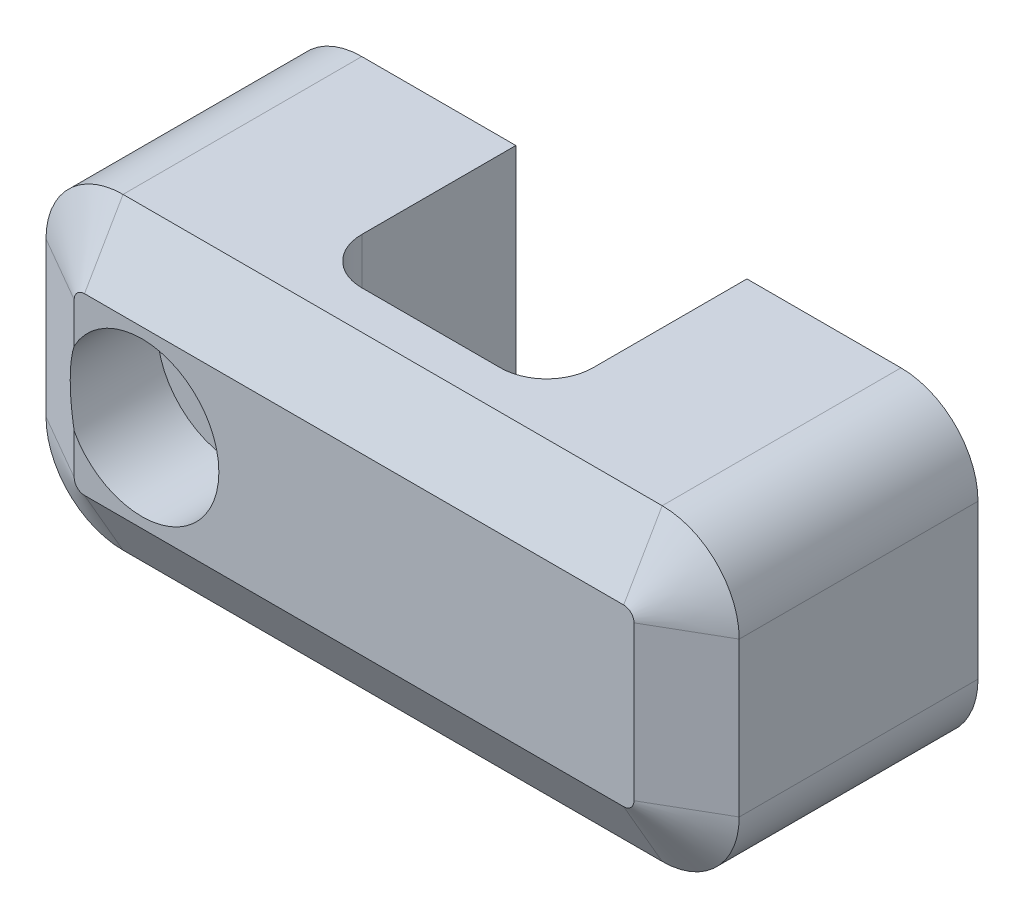
ISO-10303-21;
HEADER;
FILE_DESCRIPTION(('STEP AP214'),'2;1');
FILE_NAME('part.step','',(''),(''),'','','');
FILE_SCHEMA(('AUTOMOTIVE_DESIGN { 1 0 10303 214 1 1 1 1 }'));
ENDSEC;
DATA;
#1=APPLICATION_CONTEXT('core data for automotive mechanical design processes');
#2=APPLICATION_PROTOCOL_DEFINITION('international standard','automotive_design',2000,#1);
#3=PRODUCT_CONTEXT('',#1,'mechanical');
#4=PRODUCT('Part','Part','',(#3));
#5=PRODUCT_RELATED_PRODUCT_CATEGORY('part','',(#4));
#6=PRODUCT_DEFINITION_FORMATION('','',#4);
#7=PRODUCT_DEFINITION_CONTEXT('part definition',#1,'design');
#8=PRODUCT_DEFINITION('design','',#6,#7);
#9=PRODUCT_DEFINITION_SHAPE('','',#8);
#10=(LENGTH_UNIT() NAMED_UNIT(*) SI_UNIT(.MILLI.,.METRE.));
#11=(NAMED_UNIT(*) PLANE_ANGLE_UNIT() SI_UNIT($,.RADIAN.));
#12=(NAMED_UNIT(*) SI_UNIT($,.STERADIAN.) SOLID_ANGLE_UNIT());
#13=UNCERTAINTY_MEASURE_WITH_UNIT(LENGTH_MEASURE(1.E-05),#10,'distance_accuracy_value','');
#14=(GEOMETRIC_REPRESENTATION_CONTEXT(3) GLOBAL_UNCERTAINTY_ASSIGNED_CONTEXT((#13)) GLOBAL_UNIT_ASSIGNED_CONTEXT((#10,
#11,#12)) REPRESENTATION_CONTEXT('',''));
#15=CARTESIAN_POINT('',(0.,0.,0.));
#16=DIRECTION('',(0.,0.,1.));
#17=DIRECTION('',(1.,0.,0.));
#18=AXIS2_PLACEMENT_3D('',#15,#16,#17);
#19=CARTESIAN_POINT('',(-4.5,10.,-3.));
#20=DIRECTION('',(0.,1.,0.));
#21=DIRECTION('',(-1.,0.,0.));
#22=AXIS2_PLACEMENT_3D('',#19,#20,#21);
#23=CYLINDRICAL_SURFACE('',#22,3.);
#24=DIRECTION('',(0.,-1.,0.));
#25=VECTOR('',#24,1.);
#26=CARTESIAN_POINT('',(-7.5,10.,-3.));
#27=LINE('',#26,#25);
#28=CARTESIAN_POINT('',(-7.5,10.,-3.));
#29=VERTEX_POINT('',#28);
#30=CARTESIAN_POINT('',(-7.50000000000001,-10.,-3.));
#31=VERTEX_POINT('',#30);
#32=EDGE_CURVE('E213',#29,#31,#27,.T.);
#33=ORIENTED_EDGE('',*,*,#32,.F.);
#34=CARTESIAN_POINT('',(-4.5,10.,-3.));
#35=DIRECTION('',(0.,-1.,0.));
#36=DIRECTION('',(1.,0.,0.));
#37=AXIS2_PLACEMENT_3D('',#34,#35,#36);
#38=CIRCLE('',#37,3.);
#39=CARTESIAN_POINT('',(-4.5,10.,0.));
#40=VERTEX_POINT('',#39);
#41=EDGE_CURVE('E218',#29,#40,#38,.F.);
#42=ORIENTED_EDGE('',*,*,#41,.T.);
#43=DIRECTION('',(0.,-1.,0.));
#44=VECTOR('',#43,1.);
#45=CARTESIAN_POINT('',(-4.5,10.,0.));
#46=LINE('',#45,#44);
#47=CARTESIAN_POINT('',(-4.5,-10.,0.));
#48=VERTEX_POINT('',#47);
#49=EDGE_CURVE('E215',#48,#40,#46,.F.);
#50=ORIENTED_EDGE('',*,*,#49,.F.);
#51=CARTESIAN_POINT('',(-4.50000000000001,-10.,-3.));
#52=DIRECTION('',(0.,1.,0.));
#53=DIRECTION('',(-1.,0.,0.));
#54=AXIS2_PLACEMENT_3D('',#51,#52,#53);
#55=CIRCLE('',#54,3.);
#56=EDGE_CURVE('E221',#48,#31,#55,.F.);
#57=ORIENTED_EDGE('',*,*,#56,.T.);
#58=EDGE_LOOP('',(#33,#42,#50,#57));
#59=FACE_BOUND('',#58,.T.);
#60=ADVANCED_FACE('F33',(#59),#23,.F.);
#61=CARTESIAN_POINT('',(0.,0.,0.));
#62=DIRECTION('',(0.,0.,1.));
#63=DIRECTION('',(1.,0.,0.));
#64=AXIS2_PLACEMENT_3D('',#61,#62,#63);
#65=PLANE('',#64);
#66=DIRECTION('',(-1.,0.,0.));
#67=VECTOR('',#66,1.);
#68=CARTESIAN_POINT('',(22.5,10.,0.));
#69=LINE('',#68,#67);
#70=CARTESIAN_POINT('',(4.5,10.,0.));
#71=VERTEX_POINT('',#70);
#72=EDGE_CURVE('E211',#71,#40,#69,.T.);
#73=ORIENTED_EDGE('',*,*,#72,.F.);
#74=DIRECTION('',(0.,1.,0.));
#75=VECTOR('',#74,1.);
#76=CARTESIAN_POINT('',(4.49999999999998,-10.,0.));
#77=LINE('',#76,#75);
#78=CARTESIAN_POINT('',(4.49999999999999,-10.,0.));
#79=VERTEX_POINT('',#78);
#80=EDGE_CURVE('E54',#71,#79,#77,.F.);
#81=ORIENTED_EDGE('',*,*,#80,.T.);
#82=DIRECTION('',(1.,0.,0.));
#83=VECTOR('',#82,1.);
#84=CARTESIAN_POINT('',(22.5,-10.,0.));
#85=LINE('',#84,#83);
#86=EDGE_CURVE('E208',#48,#79,#85,.T.);
#87=ORIENTED_EDGE('',*,*,#86,.F.);
#88=ORIENTED_EDGE('',*,*,#49,.T.);
#89=EDGE_LOOP('',(#73,#81,#87,#88));
#90=FACE_BOUND('',#89,.T.);
#91=ADVANCED_FACE('F418',(#90),#65,.F.);
#92=CARTESIAN_POINT('',(-22.5,-10.,5.));
#93=DIRECTION('',(1.,0.,0.));
#94=DIRECTION('',(0.,0.,-1.));
#95=AXIS2_PLACEMENT_3D('',#92,#93,#94);
#96=PLANE('',#95);
#97=DIRECTION('',(0.,0.,-1.));
#98=VECTOR('',#97,1.);
#99=CARTESIAN_POINT('',(-22.5,-5.,5.));
#100=LINE('',#99,#98);
#101=CARTESIAN_POINT('',(-22.5,-5.,-13.));
#102=VERTEX_POINT('',#101);
#103=CARTESIAN_POINT('',(-22.5,-5.,2.49999999999999));
#104=VERTEX_POINT('',#103);
#105=EDGE_CURVE('E257',#102,#104,#100,.F.);
#106=ORIENTED_EDGE('',*,*,#105,.T.);
#107=DIRECTION('',(0.,1.,0.));
#108=VECTOR('',#107,1.);
#109=CARTESIAN_POINT('',(-22.5,5.,2.49999999999999));
#110=LINE('',#109,#108);
#111=CARTESIAN_POINT('',(-22.5,5.,2.49999999999999));
#112=VERTEX_POINT('',#111);
#113=EDGE_CURVE('E290',#104,#112,#110,.T.);
#114=ORIENTED_EDGE('',*,*,#113,.T.);
#115=DIRECTION('',(0.,0.,-1.));
#116=VECTOR('',#115,1.);
#117=CARTESIAN_POINT('',(-22.5,5.,5.));
#118=LINE('',#117,#116);
#119=CARTESIAN_POINT('',(-22.5,5.,-13.));
#120=VERTEX_POINT('',#119);
#121=EDGE_CURVE('E255',#112,#120,#118,.T.);
#122=ORIENTED_EDGE('',*,*,#121,.T.);
#123=DIRECTION('',(0.,1.,0.));
#124=VECTOR('',#123,1.);
#125=CARTESIAN_POINT('',(-22.5,10.,-13.));
#126=LINE('',#125,#124);
#127=EDGE_CURVE('E184',#102,#120,#126,.T.);
#128=ORIENTED_EDGE('',*,*,#127,.F.);
#129=EDGE_LOOP('',(#106,#114,#122,#128));
#130=FACE_BOUND('',#129,.T.);
#131=ADVANCED_FACE('F383',(#130),#96,.F.);
#132=CARTESIAN_POINT('',(22.5,-10.,5.));
#133=DIRECTION('',(0.,1.,0.));
#134=DIRECTION('',(-1.,0.,0.));
#135=AXIS2_PLACEMENT_3D('',#132,#133,#134);
#136=PLANE('',#135);
#137=ORIENTED_EDGE('',*,*,#56,.F.);
#138=ORIENTED_EDGE('',*,*,#86,.T.);
#139=CARTESIAN_POINT('',(4.49999999999998,-10.,-3.));
#140=DIRECTION('',(0.,1.,0.));
#141=DIRECTION('',(-1.,0.,0.));
#142=AXIS2_PLACEMENT_3D('',#139,#140,#141);
#143=CIRCLE('',#142,3.);
#144=CARTESIAN_POINT('',(7.49999999999998,-10.,-3.));
#145=VERTEX_POINT('',#144);
#146=EDGE_CURVE('E11',#79,#145,#143,.T.);
#147=ORIENTED_EDGE('',*,*,#146,.T.);
#148=DIRECTION('',(0.,0.,1.));
#149=VECTOR('',#148,1.);
#150=CARTESIAN_POINT('',(7.49999999999998,-10.,-13.));
#151=LINE('',#150,#149);
#152=CARTESIAN_POINT('',(7.49999999999998,-10.,-13.));
#153=VERTEX_POINT('',#152);
#154=EDGE_CURVE('E178',#153,#145,#151,.T.);
#155=ORIENTED_EDGE('',*,*,#154,.F.);
#156=DIRECTION('',(-1.,0.,0.));
#157=VECTOR('',#156,1.);
#158=CARTESIAN_POINT('',(22.5,-10.,-13.));
#159=LINE('',#158,#157);
#160=CARTESIAN_POINT('',(17.5,-10.,-13.));
#161=VERTEX_POINT('',#160);
#162=EDGE_CURVE('E162',#161,#153,#159,.T.);
#163=ORIENTED_EDGE('',*,*,#162,.F.);
#164=DIRECTION('',(0.,0.,-1.));
#165=VECTOR('',#164,1.);
#166=CARTESIAN_POINT('',(17.5,-10.,5.));
#167=LINE('',#166,#165);
#168=CARTESIAN_POINT('',(17.5,-10.,2.49999999999999));
#169=VERTEX_POINT('',#168);
#170=EDGE_CURVE('E244',#161,#169,#167,.F.);
#171=ORIENTED_EDGE('',*,*,#170,.T.);
#172=DIRECTION('',(-1.,0.,0.));
#173=VECTOR('',#172,1.);
#174=CARTESIAN_POINT('',(-17.5,-10.,2.49999999999999));
#175=LINE('',#174,#173);
#176=CARTESIAN_POINT('',(-17.5,-10.,2.49999999999999));
#177=VERTEX_POINT('',#176);
#178=EDGE_CURVE('E279',#169,#177,#175,.T.);
#179=ORIENTED_EDGE('',*,*,#178,.T.);
#180=DIRECTION('',(0.,0.,-1.));
#181=VECTOR('',#180,1.);
#182=CARTESIAN_POINT('',(-17.5,-10.,5.));
#183=LINE('',#182,#181);
#184=CARTESIAN_POINT('',(-17.5,-10.,-13.));
#185=VERTEX_POINT('',#184);
#186=EDGE_CURVE('E242',#177,#185,#183,.T.);
#187=ORIENTED_EDGE('',*,*,#186,.T.);
#188=DIRECTION('',(-1.,0.,0.));
#189=VECTOR('',#188,1.);
#190=CARTESIAN_POINT('',(-22.5,-10.,-13.));
#191=LINE('',#190,#189);
#192=CARTESIAN_POINT('',(-7.50000000000001,-10.,-13.));
#193=VERTEX_POINT('',#192);
#194=EDGE_CURVE('E199',#193,#185,#191,.T.);
#195=ORIENTED_EDGE('',*,*,#194,.F.);
#196=DIRECTION('',(0.,0.,1.));
#197=VECTOR('',#196,1.);
#198=CARTESIAN_POINT('',(-7.50000000000001,-10.,-13.));
#199=LINE('',#198,#197);
#200=EDGE_CURVE('E202',#193,#31,#199,.T.);
#201=ORIENTED_EDGE('',*,*,#200,.T.);
#202=EDGE_LOOP('',(#137,#138,#147,#155,#163,#171,#179,#187,#195,#201));
#203=FACE_BOUND('',#202,.T.);
#204=ADVANCED_FACE('F179',(#203),#136,.F.);
#205=CARTESIAN_POINT('',(22.5,-10.,5.));
#206=DIRECTION('',(-1.,0.,0.));
#207=DIRECTION('',(0.,0.,1.));
#208=AXIS2_PLACEMENT_3D('',#205,#206,#207);
#209=PLANE('',#208);
#210=DIRECTION('',(0.,0.,-1.));
#211=VECTOR('',#210,1.);
#212=CARTESIAN_POINT('',(22.5,5.,5.));
#213=LINE('',#212,#211);
#214=CARTESIAN_POINT('',(22.5,5.,-13.));
#215=VERTEX_POINT('',#214);
#216=CARTESIAN_POINT('',(22.5,5.,2.49999999999999));
#217=VERTEX_POINT('',#216);
#218=EDGE_CURVE('E226',#215,#217,#213,.F.);
#219=ORIENTED_EDGE('',*,*,#218,.T.);
#220=DIRECTION('',(0.,-1.,0.));
#221=VECTOR('',#220,1.);
#222=CARTESIAN_POINT('',(22.5,-5.,2.49999999999999));
#223=LINE('',#222,#221);
#224=CARTESIAN_POINT('',(22.5,-5.,2.49999999999999));
#225=VERTEX_POINT('',#224);
#226=EDGE_CURVE('E286',#217,#225,#223,.T.);
#227=ORIENTED_EDGE('',*,*,#226,.T.);
#228=DIRECTION('',(0.,0.,-1.));
#229=VECTOR('',#228,1.);
#230=CARTESIAN_POINT('',(22.5,-5.,5.));
#231=LINE('',#230,#229);
#232=CARTESIAN_POINT('',(22.5,-5.,-13.));
#233=VERTEX_POINT('',#232);
#234=EDGE_CURVE('E228',#225,#233,#231,.T.);
#235=ORIENTED_EDGE('',*,*,#234,.T.);
#236=DIRECTION('',(0.,-1.,0.));
#237=VECTOR('',#236,1.);
#238=CARTESIAN_POINT('',(22.5,9.99999999999998,-13.));
#239=LINE('',#238,#237);
#240=EDGE_CURVE('E175',#215,#233,#239,.T.);
#241=ORIENTED_EDGE('',*,*,#240,.F.);
#242=EDGE_LOOP('',(#219,#227,#235,#241));
#243=FACE_BOUND('',#242,.T.);
#244=ADVANCED_FACE('F339',(#243),#209,.F.);
#245=CARTESIAN_POINT('',(22.5,10.,5.));
#246=DIRECTION('',(0.,-1.,0.));
#247=DIRECTION('',(1.,0.,0.));
#248=AXIS2_PLACEMENT_3D('',#245,#246,#247);
#249=PLANE('',#248);
#250=DIRECTION('',(0.,0.,-1.));
#251=VECTOR('',#250,1.);
#252=CARTESIAN_POINT('',(-17.5,10.,5.));
#253=LINE('',#252,#251);
#254=CARTESIAN_POINT('',(-17.5,10.,-13.));
#255=VERTEX_POINT('',#254);
#256=CARTESIAN_POINT('',(-17.5,10.,2.49999999999999));
#257=VERTEX_POINT('',#256);
#258=EDGE_CURVE('E246',#255,#257,#253,.F.);
#259=ORIENTED_EDGE('',*,*,#258,.T.);
#260=DIRECTION('',(1.,0.,0.));
#261=VECTOR('',#260,1.);
#262=CARTESIAN_POINT('',(17.5,10.,2.49999999999999));
#263=LINE('',#262,#261);
#264=CARTESIAN_POINT('',(17.5,10.,2.49999999999999));
#265=VERTEX_POINT('',#264);
#266=EDGE_CURVE('E296',#257,#265,#263,.T.);
#267=ORIENTED_EDGE('',*,*,#266,.T.);
#268=DIRECTION('',(0.,0.,-1.));
#269=VECTOR('',#268,1.);
#270=CARTESIAN_POINT('',(17.5,10.,5.));
#271=LINE('',#270,#269);
#272=CARTESIAN_POINT('',(17.5,9.99999999999998,-13.));
#273=VERTEX_POINT('',#272);
#274=EDGE_CURVE('E249',#265,#273,#271,.T.);
#275=ORIENTED_EDGE('',*,*,#274,.T.);
#276=DIRECTION('',(1.,0.,0.));
#277=VECTOR('',#276,1.);
#278=CARTESIAN_POINT('',(22.5,9.99999999999998,-13.));
#279=LINE('',#278,#277);
#280=CARTESIAN_POINT('',(7.5,9.99999999999999,-13.));
#281=VERTEX_POINT('',#280);
#282=EDGE_CURVE('E335',#281,#273,#279,.T.);
#283=ORIENTED_EDGE('',*,*,#282,.F.);
#284=DIRECTION('',(0.,0.,1.));
#285=VECTOR('',#284,1.);
#286=CARTESIAN_POINT('',(7.5,9.99999999999999,-13.));
#287=LINE('',#286,#285);
#288=CARTESIAN_POINT('',(7.5,9.99999999999999,-3.));
#289=VERTEX_POINT('',#288);
#290=EDGE_CURVE('E185',#281,#289,#287,.T.);
#291=ORIENTED_EDGE('',*,*,#290,.T.);
#292=CARTESIAN_POINT('',(4.5,10.,-3.));
#293=DIRECTION('',(0.,-1.,0.));
#294=DIRECTION('',(1.,0.,0.));
#295=AXIS2_PLACEMENT_3D('',#292,#293,#294);
#296=CIRCLE('',#295,3.);
#297=EDGE_CURVE('E41',#289,#71,#296,.T.);
#298=ORIENTED_EDGE('',*,*,#297,.T.);
#299=ORIENTED_EDGE('',*,*,#72,.T.);
#300=ORIENTED_EDGE('',*,*,#41,.F.);
#301=DIRECTION('',(0.,0.,1.));
#302=VECTOR('',#301,1.);
#303=CARTESIAN_POINT('',(-7.5,10.,-13.));
#304=LINE('',#303,#302);
#305=CARTESIAN_POINT('',(-7.5,10.,-13.));
#306=VERTEX_POINT('',#305);
#307=EDGE_CURVE('E212',#306,#29,#304,.T.);
#308=ORIENTED_EDGE('',*,*,#307,.F.);
#309=DIRECTION('',(1.,0.,0.));
#310=VECTOR('',#309,1.);
#311=CARTESIAN_POINT('',(-22.5,10.,-13.));
#312=LINE('',#311,#310);
#313=EDGE_CURVE('E195',#255,#306,#312,.T.);
#314=ORIENTED_EDGE('',*,*,#313,.F.);
#315=EDGE_LOOP('',(#259,#267,#275,#283,#291,#298,#299,#300,#308,#314));
#316=FACE_BOUND('',#315,.T.);
#317=ADVANCED_FACE('F397',(#316),#249,.F.);
#318=CARTESIAN_POINT('',(0.,0.,5.));
#319=DIRECTION('',(0.,0.,1.));
#320=DIRECTION('',(1.,0.,0.));
#321=AXIS2_PLACEMENT_3D('',#318,#319,#320);
#322=PLANE('',#321);
#323=CARTESIAN_POINT('',(-13.7784095503576,0.,5.));
#324=DIRECTION('',(0.,0.,1.));
#325=DIRECTION('',(1.,0.,0.));
#326=AXIS2_PLACEMENT_3D('',#323,#324,#325);
#327=CIRCLE('',#326,5.);
#328=CARTESIAN_POINT('',(-18.1698729810778,-2.39061685274892,5.));
#329=VERTEX_POINT('',#328);
#330=CARTESIAN_POINT('',(-18.1698729810778,2.39061685274891,5.));
#331=VERTEX_POINT('',#330);
#332=EDGE_CURVE('E329',#329,#331,#327,.T.);
#333=ORIENTED_EDGE('',*,*,#332,.F.);
#334=DIRECTION('',(0.,-1.,0.));
#335=VECTOR('',#334,1.);
#336=CARTESIAN_POINT('',(-18.1698729810778,-5.,5.));
#337=LINE('',#336,#335);
#338=CARTESIAN_POINT('',(-18.1698729810778,-5.,5.));
#339=VERTEX_POINT('',#338);
#340=EDGE_CURVE('E277',#329,#339,#337,.T.);
#341=ORIENTED_EDGE('',*,*,#340,.T.);
#342=CARTESIAN_POINT('',(-17.5,-5.,5.));
#343=DIRECTION('',(0.,0.,1.));
#344=DIRECTION('',(1.,0.,0.));
#345=AXIS2_PLACEMENT_3D('',#342,#343,#344);
#346=CIRCLE('',#345,0.669872981077815);
#347=CARTESIAN_POINT('',(-17.5,-5.66987298107782,5.));
#348=VERTEX_POINT('',#347);
#349=EDGE_CURVE('E275',#339,#348,#346,.T.);
#350=ORIENTED_EDGE('',*,*,#349,.T.);
#351=DIRECTION('',(1.,0.,0.));
#352=VECTOR('',#351,1.);
#353=CARTESIAN_POINT('',(17.5,-5.66987298107781,5.));
#354=LINE('',#353,#352);
#355=CARTESIAN_POINT('',(17.5,-5.66987298107781,5.));
#356=VERTEX_POINT('',#355);
#357=EDGE_CURVE('E272',#348,#356,#354,.T.);
#358=ORIENTED_EDGE('',*,*,#357,.T.);
#359=CARTESIAN_POINT('',(17.5,-5.,5.));
#360=DIRECTION('',(0.,0.,1.));
#361=DIRECTION('',(1.,0.,0.));
#362=AXIS2_PLACEMENT_3D('',#359,#360,#361);
#363=CIRCLE('',#362,0.669872981077815);
#364=CARTESIAN_POINT('',(18.1698729810778,-5.,5.));
#365=VERTEX_POINT('',#364);
#366=EDGE_CURVE('E270',#356,#365,#363,.T.);
#367=ORIENTED_EDGE('',*,*,#366,.T.);
#368=DIRECTION('',(0.,1.,0.));
#369=VECTOR('',#368,1.);
#370=CARTESIAN_POINT('',(18.1698729810778,5.,5.));
#371=LINE('',#370,#369);
#372=CARTESIAN_POINT('',(18.1698729810778,5.,5.));
#373=VERTEX_POINT('',#372);
#374=EDGE_CURVE('E268',#365,#373,#371,.T.);
#375=ORIENTED_EDGE('',*,*,#374,.T.);
#376=CARTESIAN_POINT('',(17.5,5.,5.));
#377=DIRECTION('',(0.,0.,1.));
#378=DIRECTION('',(1.,0.,0.));
#379=AXIS2_PLACEMENT_3D('',#376,#377,#378);
#380=CIRCLE('',#379,0.669872981077815);
#381=CARTESIAN_POINT('',(17.5,5.66987298107782,5.));
#382=VERTEX_POINT('',#381);
#383=EDGE_CURVE('E264',#373,#382,#380,.T.);
#384=ORIENTED_EDGE('',*,*,#383,.T.);
#385=DIRECTION('',(-1.,0.,0.));
#386=VECTOR('',#385,1.);
#387=CARTESIAN_POINT('',(-17.5,5.66987298107781,5.));
#388=LINE('',#387,#386);
#389=CARTESIAN_POINT('',(-17.5,5.66987298107781,5.));
#390=VERTEX_POINT('',#389);
#391=EDGE_CURVE('E260',#382,#390,#388,.T.);
#392=ORIENTED_EDGE('',*,*,#391,.T.);
#393=CARTESIAN_POINT('',(-17.5,5.,5.));
#394=DIRECTION('',(0.,0.,1.));
#395=DIRECTION('',(1.,0.,0.));
#396=AXIS2_PLACEMENT_3D('',#393,#394,#395);
#397=CIRCLE('',#396,0.669872981077815);
#398=CARTESIAN_POINT('',(-18.1698729810778,5.,5.));
#399=VERTEX_POINT('',#398);
#400=EDGE_CURVE('E262',#390,#399,#397,.T.);
#401=ORIENTED_EDGE('',*,*,#400,.T.);
#402=DIRECTION('',(0.,-1.,0.));
#403=VECTOR('',#402,1.);
#404=CARTESIAN_POINT('',(-18.1698729810778,-5.,5.));
#405=LINE('',#404,#403);
#406=EDGE_CURVE('E266',#399,#331,#405,.T.);
#407=ORIENTED_EDGE('',*,*,#406,.T.);
#408=EDGE_LOOP('',(#333,#341,#350,#358,#367,#375,#384,#392,#401,#407));
#409=FACE_BOUND('',#408,.T.);
#410=ADVANCED_FACE('F370',(#409),#322,.T.);
#411=CARTESIAN_POINT('',(-7.5,10.,-13.));
#412=DIRECTION('',(-1.,0.,0.));
#413=DIRECTION('',(0.,-1.,0.));
#414=AXIS2_PLACEMENT_3D('',#411,#412,#413);
#415=PLANE('',#414);
#416=ORIENTED_EDGE('',*,*,#307,.T.);
#417=ORIENTED_EDGE('',*,*,#32,.T.);
#418=ORIENTED_EDGE('',*,*,#200,.F.);
#419=DIRECTION('',(0.,-1.,0.));
#420=VECTOR('',#419,1.);
#421=CARTESIAN_POINT('',(-7.5,10.,-13.));
#422=LINE('',#421,#420);
#423=EDGE_CURVE('E197',#306,#193,#422,.T.);
#424=ORIENTED_EDGE('',*,*,#423,.F.);
#425=EDGE_LOOP('',(#416,#417,#418,#424));
#426=FACE_BOUND('',#425,.T.);
#427=ADVANCED_FACE('F460',(#426),#415,.F.);
#428=CARTESIAN_POINT('',(0.,0.,-13.));
#429=DIRECTION('',(0.,0.,1.));
#430=DIRECTION('',(1.,0.,0.));
#431=AXIS2_PLACEMENT_3D('',#428,#429,#430);
#432=PLANE('',#431);
#433=CARTESIAN_POINT('',(-13.7784095503576,0.,-13.));
#434=DIRECTION('',(0.,0.,1.));
#435=DIRECTION('',(1.,0.,0.));
#436=AXIS2_PLACEMENT_3D('',#433,#434,#435);
#437=CIRCLE('',#436,2.5);
#438=CARTESIAN_POINT('',(-11.2784095503576,0.,-13.));
#439=VERTEX_POINT('',#438);
#440=EDGE_CURVE('E324',#439,#439,#437,.T.);
#441=ORIENTED_EDGE('',*,*,#440,.T.);
#442=EDGE_LOOP('',(#441));
#443=FACE_BOUND('',#442,.T.);
#444=ORIENTED_EDGE('',*,*,#194,.T.);
#445=CARTESIAN_POINT('',(-17.5,-5.,-13.));
#446=DIRECTION('',(0.,0.,1.));
#447=DIRECTION('',(1.,0.,0.));
#448=AXIS2_PLACEMENT_3D('',#445,#446,#447);
#449=CIRCLE('',#448,5.);
#450=EDGE_CURVE('E253',#185,#102,#449,.F.);
#451=ORIENTED_EDGE('',*,*,#450,.T.);
#452=ORIENTED_EDGE('',*,*,#127,.T.);
#453=CARTESIAN_POINT('',(-17.5,5.,-13.));
#454=DIRECTION('',(0.,0.,1.));
#455=DIRECTION('',(1.,0.,0.));
#456=AXIS2_PLACEMENT_3D('',#453,#454,#455);
#457=CIRCLE('',#456,5.);
#458=EDGE_CURVE('E251',#120,#255,#457,.F.);
#459=ORIENTED_EDGE('',*,*,#458,.T.);
#460=ORIENTED_EDGE('',*,*,#313,.T.);
#461=ORIENTED_EDGE('',*,*,#423,.T.);
#462=EDGE_LOOP('',(#444,#451,#452,#459,#460,#461));
#463=FACE_BOUND('',#462,.T.);
#464=ADVANCED_FACE('F463',(#443,#463),#432,.F.);
#465=CARTESIAN_POINT('',(7.5,9.99999999999999,-13.));
#466=DIRECTION('',(1.,0.,0.));
#467=DIRECTION('',(0.,1.,0.));
#468=AXIS2_PLACEMENT_3D('',#465,#466,#467);
#469=PLANE('',#468);
#470=ORIENTED_EDGE('',*,*,#154,.T.);
#471=DIRECTION('',(0.,1.,0.));
#472=VECTOR('',#471,1.);
#473=CARTESIAN_POINT('',(7.5,10.,-3.));
#474=LINE('',#473,#472);
#475=EDGE_CURVE('E223',#145,#289,#474,.T.);
#476=ORIENTED_EDGE('',*,*,#475,.T.);
#477=ORIENTED_EDGE('',*,*,#290,.F.);
#478=DIRECTION('',(0.,1.,0.));
#479=VECTOR('',#478,1.);
#480=CARTESIAN_POINT('',(7.5,9.99999999999999,-13.));
#481=LINE('',#480,#479);
#482=EDGE_CURVE('E168',#153,#281,#481,.T.);
#483=ORIENTED_EDGE('',*,*,#482,.F.);
#484=EDGE_LOOP('',(#470,#476,#477,#483));
#485=FACE_BOUND('',#484,.T.);
#486=ADVANCED_FACE('F187',(#485),#469,.F.);
#487=CARTESIAN_POINT('',(0.,0.,-13.));
#488=DIRECTION('',(0.,0.,1.));
#489=DIRECTION('',(1.,0.,0.));
#490=AXIS2_PLACEMENT_3D('',#487,#488,#489);
#491=PLANE('',#490);
#492=ORIENTED_EDGE('',*,*,#240,.T.);
#493=CARTESIAN_POINT('',(17.5,-5.,-13.));
#494=DIRECTION('',(0.,0.,1.));
#495=DIRECTION('',(1.,0.,0.));
#496=AXIS2_PLACEMENT_3D('',#493,#494,#495);
#497=CIRCLE('',#496,5.);
#498=EDGE_CURVE('E171',#233,#161,#497,.F.);
#499=ORIENTED_EDGE('',*,*,#498,.T.);
#500=ORIENTED_EDGE('',*,*,#162,.T.);
#501=ORIENTED_EDGE('',*,*,#482,.T.);
#502=ORIENTED_EDGE('',*,*,#282,.T.);
#503=CARTESIAN_POINT('',(17.5,5.,-13.));
#504=DIRECTION('',(0.,0.,1.));
#505=DIRECTION('',(1.,0.,0.));
#506=AXIS2_PLACEMENT_3D('',#503,#504,#505);
#507=CIRCLE('',#506,5.);
#508=EDGE_CURVE('E234',#273,#215,#507,.F.);
#509=ORIENTED_EDGE('',*,*,#508,.T.);
#510=EDGE_LOOP('',(#492,#499,#500,#501,#502,#509));
#511=FACE_BOUND('',#510,.T.);
#512=ADVANCED_FACE('F165',(#511),#491,.F.);
#513=CARTESIAN_POINT('',(-13.7784095503576,0.,-1.));
#514=DIRECTION('',(0.,0.,1.));
#515=DIRECTION('',(1.,0.,0.));
#516=AXIS2_PLACEMENT_3D('',#513,#514,#515);
#517=CYLINDRICAL_SURFACE('',#516,5.);
#518=CARTESIAN_POINT('',(-13.7784095503576,0.,-1.));
#519=DIRECTION('',(0.,0.,1.));
#520=DIRECTION('',(1.,0.,0.));
#521=AXIS2_PLACEMENT_3D('',#518,#519,#520);
#522=CIRCLE('',#521,5.);
#523=CARTESIAN_POINT('',(-8.77840955035761,0.,-1.));
#524=VERTEX_POINT('',#523);
#525=EDGE_CURVE('E332',#524,#524,#522,.T.);
#526=ORIENTED_EDGE('',*,*,#525,.F.);
#527=EDGE_LOOP('',(#526));
#528=FACE_BOUND('',#527,.T.);
#529=ORIENTED_EDGE('',*,*,#332,.T.);
#530=CARTESIAN_POINT('',(-13.7784095503576,0.,7.53541259386272));
#531=DIRECTION('',(-0.500000000000001,0.,0.866025403784438));
#532=DIRECTION('',(0.866025403784438,0.,0.500000000000002));
#533=AXIS2_PLACEMENT_3D('',#530,#531,#532);
#534=ELLIPSE('',#533,5.77350269189627,5.);
#535=EDGE_CURVE('E288',#331,#329,#534,.T.);
#536=ORIENTED_EDGE('',*,*,#535,.T.);
#537=EDGE_LOOP('',(#529,#536));
#538=FACE_BOUND('',#537,.T.);
#539=ADVANCED_FACE('F403',(#528,#538),#517,.F.);
#540=CARTESIAN_POINT('',(-13.7784095503576,0.,-1.));
#541=DIRECTION('',(0.,0.,1.));
#542=DIRECTION('',(1.,0.,0.));
#543=AXIS2_PLACEMENT_3D('',#540,#541,#542);
#544=PLANE('',#543);
#545=CARTESIAN_POINT('',(-13.7784095503576,0.,-1.));
#546=DIRECTION('',(0.,0.,1.));
#547=DIRECTION('',(1.,0.,0.));
#548=AXIS2_PLACEMENT_3D('',#545,#546,#547);
#549=CIRCLE('',#548,2.5);
#550=CARTESIAN_POINT('',(-11.2784095503576,0.,-1.));
#551=VERTEX_POINT('',#550);
#552=EDGE_CURVE('E318',#551,#551,#549,.T.);
#553=ORIENTED_EDGE('',*,*,#552,.F.);
#554=EDGE_LOOP('',(#553));
#555=FACE_BOUND('',#554,.T.);
#556=ORIENTED_EDGE('',*,*,#525,.T.);
#557=EDGE_LOOP('',(#556));
#558=FACE_BOUND('',#557,.T.);
#559=ADVANCED_FACE('F405',(#555,#558),#544,.T.);
#560=CARTESIAN_POINT('',(-13.7784095503576,0.,-17.));
#561=DIRECTION('',(0.,0.,1.));
#562=DIRECTION('',(1.,0.,0.));
#563=AXIS2_PLACEMENT_3D('',#560,#561,#562);
#564=CYLINDRICAL_SURFACE('',#563,2.5);
#565=ORIENTED_EDGE('',*,*,#552,.T.);
#566=EDGE_LOOP('',(#565));
#567=FACE_BOUND('',#566,.T.);
#568=ORIENTED_EDGE('',*,*,#440,.F.);
#569=EDGE_LOOP('',(#568));
#570=FACE_BOUND('',#569,.T.);
#571=ADVANCED_FACE('F412',(#567,#570),#564,.F.);
#572=CARTESIAN_POINT('',(17.5,-5.,5.));
#573=DIRECTION('',(0.,0.,-1.));
#574=DIRECTION('',(-1.,0.,0.));
#575=AXIS2_PLACEMENT_3D('',#572,#573,#574);
#576=CYLINDRICAL_SURFACE('',#575,5.);
#577=ORIENTED_EDGE('',*,*,#234,.F.);
#578=CARTESIAN_POINT('',(17.5,-5.,2.49999999999999));
#579=DIRECTION('',(0.,0.,1.));
#580=DIRECTION('',(1.,0.,0.));
#581=AXIS2_PLACEMENT_3D('',#578,#579,#580);
#582=CIRCLE('',#581,5.);
#583=EDGE_CURVE('E282',#225,#169,#582,.F.);
#584=ORIENTED_EDGE('',*,*,#583,.T.);
#585=ORIENTED_EDGE('',*,*,#170,.F.);
#586=ORIENTED_EDGE('',*,*,#498,.F.);
#587=EDGE_LOOP('',(#577,#584,#585,#586));
#588=FACE_BOUND('',#587,.T.);
#589=ADVANCED_FACE('F356',(#588),#576,.T.);
#590=CARTESIAN_POINT('',(17.5,5.,5.));
#591=DIRECTION('',(0.,0.,-1.));
#592=DIRECTION('',(-1.,0.,0.));
#593=AXIS2_PLACEMENT_3D('',#590,#591,#592);
#594=CYLINDRICAL_SURFACE('',#593,5.);
#595=ORIENTED_EDGE('',*,*,#274,.F.);
#596=CARTESIAN_POINT('',(17.5,5.,2.49999999999999));
#597=DIRECTION('',(0.,0.,1.));
#598=DIRECTION('',(1.,0.,0.));
#599=AXIS2_PLACEMENT_3D('',#596,#597,#598);
#600=CIRCLE('',#599,5.);
#601=EDGE_CURVE('E292',#265,#217,#600,.F.);
#602=ORIENTED_EDGE('',*,*,#601,.T.);
#603=ORIENTED_EDGE('',*,*,#218,.F.);
#604=ORIENTED_EDGE('',*,*,#508,.F.);
#605=EDGE_LOOP('',(#595,#602,#603,#604));
#606=FACE_BOUND('',#605,.T.);
#607=ADVANCED_FACE('F343',(#606),#594,.T.);
#608=CARTESIAN_POINT('',(-17.5,-5.,5.));
#609=DIRECTION('',(0.,0.,-1.));
#610=DIRECTION('',(-1.,0.,0.));
#611=AXIS2_PLACEMENT_3D('',#608,#609,#610);
#612=CYLINDRICAL_SURFACE('',#611,5.);
#613=ORIENTED_EDGE('',*,*,#186,.F.);
#614=CARTESIAN_POINT('',(-17.5,-5.,2.49999999999999));
#615=DIRECTION('',(0.,0.,1.));
#616=DIRECTION('',(1.,0.,0.));
#617=AXIS2_PLACEMENT_3D('',#614,#615,#616);
#618=CIRCLE('',#617,5.);
#619=EDGE_CURVE('E284',#177,#104,#618,.F.);
#620=ORIENTED_EDGE('',*,*,#619,.T.);
#621=ORIENTED_EDGE('',*,*,#105,.F.);
#622=ORIENTED_EDGE('',*,*,#450,.F.);
#623=EDGE_LOOP('',(#613,#620,#621,#622));
#624=FACE_BOUND('',#623,.T.);
#625=ADVANCED_FACE('F378',(#624),#612,.T.);
#626=CARTESIAN_POINT('',(-17.5,5.,5.));
#627=DIRECTION('',(0.,0.,-1.));
#628=DIRECTION('',(-1.,0.,0.));
#629=AXIS2_PLACEMENT_3D('',#626,#627,#628);
#630=CYLINDRICAL_SURFACE('',#629,5.);
#631=ORIENTED_EDGE('',*,*,#121,.F.);
#632=CARTESIAN_POINT('',(-17.5,5.,2.49999999999999));
#633=DIRECTION('',(0.,0.,1.));
#634=DIRECTION('',(1.,0.,0.));
#635=AXIS2_PLACEMENT_3D('',#632,#633,#634);
#636=CIRCLE('',#635,5.);
#637=EDGE_CURVE('E294',#112,#257,#636,.F.);
#638=ORIENTED_EDGE('',*,*,#637,.T.);
#639=ORIENTED_EDGE('',*,*,#258,.F.);
#640=ORIENTED_EDGE('',*,*,#458,.F.);
#641=EDGE_LOOP('',(#631,#638,#639,#640));
#642=FACE_BOUND('',#641,.T.);
#643=ADVANCED_FACE('F393',(#642),#630,.T.);
#644=CARTESIAN_POINT('',(0.,5.66987298107781,5.));
#645=DIRECTION('',(0.,0.500000000000001,0.866025403784438));
#646=DIRECTION('',(1.,0.,0.));
#647=AXIS2_PLACEMENT_3D('',#644,#645,#646);
#648=PLANE('',#647);
#649=DIRECTION('',(0.,-0.866025403784438,0.500000000000001));
#650=VECTOR('',#649,1.);
#651=CARTESIAN_POINT('',(17.5,10.,2.49999999999999));
#652=LINE('',#651,#650);
#653=EDGE_CURVE('E314',#265,#382,#652,.T.);
#654=ORIENTED_EDGE('',*,*,#653,.F.);
#655=ORIENTED_EDGE('',*,*,#266,.F.);
#656=DIRECTION('',(0.,0.866025403784438,-0.500000000000001));
#657=VECTOR('',#656,1.);
#658=CARTESIAN_POINT('',(-17.5,5.66987298107781,5.));
#659=LINE('',#658,#657);
#660=EDGE_CURVE('E316',#390,#257,#659,.T.);
#661=ORIENTED_EDGE('',*,*,#660,.F.);
#662=ORIENTED_EDGE('',*,*,#391,.F.);
#663=EDGE_LOOP('',(#654,#655,#661,#662));
#664=FACE_BOUND('',#663,.T.);
#665=ADVANCED_FACE('F400',(#664),#648,.T.);
#666=CARTESIAN_POINT('',(-17.5,5.,5.));
#667=DIRECTION('',(0.,0.,-1.));
#668=DIRECTION('',(-1.,0.,0.));
#669=AXIS2_PLACEMENT_3D('',#666,#667,#668);
#670=CONICAL_SURFACE('',#669,0.669872981077814,1.0471975511966);
#671=ORIENTED_EDGE('',*,*,#660,.T.);
#672=ORIENTED_EDGE('',*,*,#637,.F.);
#673=DIRECTION('',(-0.866025403784438,0.,-0.500000000000001));
#674=VECTOR('',#673,1.);
#675=CARTESIAN_POINT('',(-18.1698729810778,5.,5.));
#676=LINE('',#675,#674);
#677=EDGE_CURVE('E311',#399,#112,#676,.T.);
#678=ORIENTED_EDGE('',*,*,#677,.F.);
#679=ORIENTED_EDGE('',*,*,#400,.F.);
#680=EDGE_LOOP('',(#671,#672,#678,#679));
#681=FACE_BOUND('',#680,.T.);
#682=ADVANCED_FACE('F390',(#681),#670,.T.);
#683=CARTESIAN_POINT('',(17.5,5.,5.));
#684=DIRECTION('',(0.,0.,-1.));
#685=DIRECTION('',(-1.,0.,0.));
#686=AXIS2_PLACEMENT_3D('',#683,#684,#685);
#687=CONICAL_SURFACE('',#686,0.669872981077815,1.0471975511966);
#688=ORIENTED_EDGE('',*,*,#653,.T.);
#689=ORIENTED_EDGE('',*,*,#383,.F.);
#690=DIRECTION('',(-0.866025403784438,0.,0.500000000000001));
#691=VECTOR('',#690,1.);
#692=CARTESIAN_POINT('',(22.5,5.,2.49999999999999));
#693=LINE('',#692,#691);
#694=EDGE_CURVE('E308',#217,#373,#693,.T.);
#695=ORIENTED_EDGE('',*,*,#694,.F.);
#696=ORIENTED_EDGE('',*,*,#601,.F.);
#697=EDGE_LOOP('',(#688,#689,#695,#696));
#698=FACE_BOUND('',#697,.T.);
#699=ADVANCED_FACE('F347',(#698),#687,.T.);
#700=CARTESIAN_POINT('',(-18.1698729810778,0.,5.));
#701=DIRECTION('',(-0.500000000000001,0.,0.866025403784438));
#702=DIRECTION('',(0.,1.,0.));
#703=AXIS2_PLACEMENT_3D('',#700,#701,#702);
#704=PLANE('',#703);
#705=ORIENTED_EDGE('',*,*,#677,.T.);
#706=ORIENTED_EDGE('',*,*,#113,.F.);
#707=DIRECTION('',(-0.866025403784438,0.,-0.500000000000001));
#708=VECTOR('',#707,1.);
#709=CARTESIAN_POINT('',(-18.1698729810778,-5.,5.));
#710=LINE('',#709,#708);
#711=EDGE_CURVE('E305',#339,#104,#710,.T.);
#712=ORIENTED_EDGE('',*,*,#711,.F.);
#713=ORIENTED_EDGE('',*,*,#340,.F.);
#714=ORIENTED_EDGE('',*,*,#535,.F.);
#715=ORIENTED_EDGE('',*,*,#406,.F.);
#716=EDGE_LOOP('',(#705,#706,#712,#713,#714,#715));
#717=FACE_BOUND('',#716,.T.);
#718=ADVANCED_FACE('F386',(#717),#704,.T.);
#719=CARTESIAN_POINT('',(18.1698729810778,0.,5.));
#720=DIRECTION('',(0.500000000000001,0.,0.866025403784438));
#721=DIRECTION('',(0.,-1.,0.));
#722=AXIS2_PLACEMENT_3D('',#719,#720,#721);
#723=PLANE('',#722);
#724=ORIENTED_EDGE('',*,*,#694,.T.);
#725=ORIENTED_EDGE('',*,*,#374,.F.);
#726=DIRECTION('',(-0.866025403784438,0.,0.500000000000001));
#727=VECTOR('',#726,1.);
#728=CARTESIAN_POINT('',(22.5,-5.,2.49999999999999));
#729=LINE('',#728,#727);
#730=EDGE_CURVE('E302',#225,#365,#729,.T.);
#731=ORIENTED_EDGE('',*,*,#730,.F.);
#732=ORIENTED_EDGE('',*,*,#226,.F.);
#733=EDGE_LOOP('',(#724,#725,#731,#732));
#734=FACE_BOUND('',#733,.T.);
#735=ADVANCED_FACE('F353',(#734),#723,.T.);
#736=CARTESIAN_POINT('',(-17.5,-5.,5.));
#737=DIRECTION('',(0.,0.,-1.));
#738=DIRECTION('',(-1.,0.,0.));
#739=AXIS2_PLACEMENT_3D('',#736,#737,#738);
#740=CONICAL_SURFACE('',#739,0.669872981077815,1.0471975511966);
#741=ORIENTED_EDGE('',*,*,#711,.T.);
#742=ORIENTED_EDGE('',*,*,#619,.F.);
#743=DIRECTION('',(0.,-0.866025403784438,-0.500000000000001));
#744=VECTOR('',#743,1.);
#745=CARTESIAN_POINT('',(-17.5,-5.66987298107782,5.));
#746=LINE('',#745,#744);
#747=EDGE_CURVE('E300',#348,#177,#746,.T.);
#748=ORIENTED_EDGE('',*,*,#747,.F.);
#749=ORIENTED_EDGE('',*,*,#349,.F.);
#750=EDGE_LOOP('',(#741,#742,#748,#749));
#751=FACE_BOUND('',#750,.T.);
#752=ADVANCED_FACE('F375',(#751),#740,.T.);
#753=CARTESIAN_POINT('',(17.5,-5.,5.));
#754=DIRECTION('',(0.,0.,-1.));
#755=DIRECTION('',(-1.,0.,0.));
#756=AXIS2_PLACEMENT_3D('',#753,#754,#755);
#757=CONICAL_SURFACE('',#756,0.669872981077814,1.0471975511966);
#758=ORIENTED_EDGE('',*,*,#730,.T.);
#759=ORIENTED_EDGE('',*,*,#366,.F.);
#760=DIRECTION('',(0.,0.866025403784438,0.500000000000002));
#761=VECTOR('',#760,1.);
#762=CARTESIAN_POINT('',(17.5,-10.,2.49999999999999));
#763=LINE('',#762,#761);
#764=EDGE_CURVE('E298',#169,#356,#763,.T.);
#765=ORIENTED_EDGE('',*,*,#764,.F.);
#766=ORIENTED_EDGE('',*,*,#583,.F.);
#767=EDGE_LOOP('',(#758,#759,#765,#766));
#768=FACE_BOUND('',#767,.T.);
#769=ADVANCED_FACE('F367',(#768),#757,.T.);
#770=CARTESIAN_POINT('',(0.,-5.66987298107781,5.));
#771=DIRECTION('',(0.,-0.500000000000001,0.866025403784438));
#772=DIRECTION('',(-1.,0.,0.));
#773=AXIS2_PLACEMENT_3D('',#770,#771,#772);
#774=PLANE('',#773);
#775=ORIENTED_EDGE('',*,*,#747,.T.);
#776=ORIENTED_EDGE('',*,*,#178,.F.);
#777=ORIENTED_EDGE('',*,*,#764,.T.);
#778=ORIENTED_EDGE('',*,*,#357,.F.);
#779=EDGE_LOOP('',(#775,#776,#777,#778));
#780=FACE_BOUND('',#779,.T.);
#781=ADVANCED_FACE('F361',(#780),#774,.T.);
#782=CARTESIAN_POINT('',(4.5,9.99999999999999,-3.));
#783=DIRECTION('',(0.,-1.,0.));
#784=DIRECTION('',(1.,0.,0.));
#785=AXIS2_PLACEMENT_3D('',#782,#783,#784);
#786=CYLINDRICAL_SURFACE('',#785,3.);
#787=ORIENTED_EDGE('',*,*,#146,.F.);
#788=ORIENTED_EDGE('',*,*,#80,.F.);
#789=ORIENTED_EDGE('',*,*,#297,.F.);
#790=ORIENTED_EDGE('',*,*,#475,.F.);
#791=EDGE_LOOP('',(#787,#788,#789,#790));
#792=FACE_BOUND('',#791,.T.);
#793=ADVANCED_FACE('F35',(#792),#786,.F.);
#794=CLOSED_SHELL('',(#60,#91,#131,#204,#244,#317,#410,#427,#464,#486,#512,#539,#559,#571,#589,
#607,#625,#643,#665,#682,#699,#718,#735,#752,#769,#781,#793));
#795=MANIFOLD_SOLID_BREP('B2',#794);
#796=ADVANCED_BREP_SHAPE_REPRESENTATION('',(#18,#795),#14);
#797=SHAPE_DEFINITION_REPRESENTATION(#9,#796);
ENDSEC;
END-ISO-10303-21;
